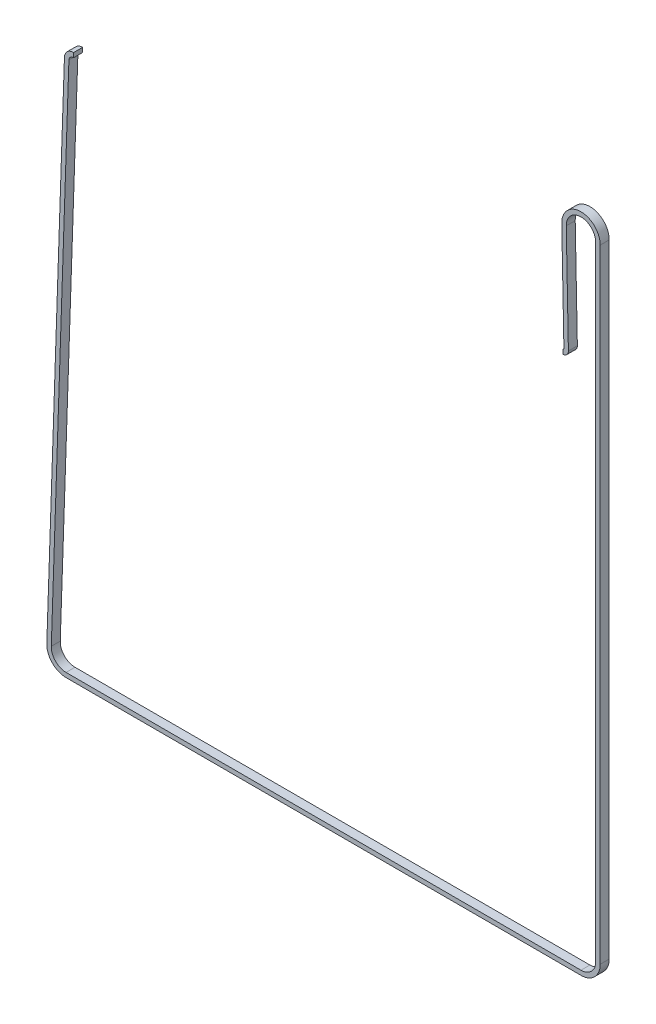
ISO-10303-21;
HEADER;
FILE_DESCRIPTION(('STEP AP214'),'2;1');
FILE_NAME('part.step','',(''),(''),'','','');
FILE_SCHEMA(('AUTOMOTIVE_DESIGN { 1 0 10303 214 1 1 1 1 }'));
ENDSEC;
DATA;
#1=APPLICATION_CONTEXT('core data for automotive mechanical design processes');
#2=APPLICATION_PROTOCOL_DEFINITION('international standard','automotive_design',2000,#1);
#3=PRODUCT_CONTEXT('',#1,'mechanical');
#4=PRODUCT('Part','Part','',(#3));
#5=PRODUCT_RELATED_PRODUCT_CATEGORY('part','',(#4));
#6=PRODUCT_DEFINITION_FORMATION('','',#4);
#7=PRODUCT_DEFINITION_CONTEXT('part definition',#1,'design');
#8=PRODUCT_DEFINITION('design','',#6,#7);
#9=PRODUCT_DEFINITION_SHAPE('','',#8);
#10=(LENGTH_UNIT() NAMED_UNIT(*) SI_UNIT(.MILLI.,.METRE.));
#11=(NAMED_UNIT(*) PLANE_ANGLE_UNIT() SI_UNIT($,.RADIAN.));
#12=(NAMED_UNIT(*) SI_UNIT($,.STERADIAN.) SOLID_ANGLE_UNIT());
#13=UNCERTAINTY_MEASURE_WITH_UNIT(LENGTH_MEASURE(1.E-05),#10,'distance_accuracy_value','');
#14=(GEOMETRIC_REPRESENTATION_CONTEXT(3) GLOBAL_UNCERTAINTY_ASSIGNED_CONTEXT((#13)) GLOBAL_UNIT_ASSIGNED_CONTEXT((#10,
#11,#12)) REPRESENTATION_CONTEXT('',''));
#15=CARTESIAN_POINT('',(0.,0.,0.));
#16=DIRECTION('',(0.,0.,1.));
#17=DIRECTION('',(1.,0.,0.));
#18=AXIS2_PLACEMENT_3D('',#15,#16,#17);
#19=CARTESIAN_POINT('',(0.,0.,6.));
#20=DIRECTION('',(0.,0.,1.));
#21=DIRECTION('',(1.,0.,0.));
#22=AXIS2_PLACEMENT_3D('',#19,#20,#21);
#23=PLANE('',#22);
#24=DIRECTION('',(-0.999688844422703,0.0249442245179105,0.));
#25=VECTOR('',#24,1.);
#26=CARTESIAN_POINT('',(-327.646355689462,4.49928423617703,6.));
#27=LINE('',#26,#25);
#28=CARTESIAN_POINT('',(-327.571523015909,4.49741701216947,6.));
#29=VERTEX_POINT('',#28);
#30=CARTESIAN_POINT('',(-327.646355689462,4.49928423617703,6.));
#31=VERTEX_POINT('',#30);
#32=EDGE_CURVE('E251',#29,#31,#27,.T.);
#33=ORIENTED_EDGE('',*,*,#32,.F.);
#34=DIRECTION('',(0.,-1.,0.));
#35=VECTOR('',#34,1.);
#36=CARTESIAN_POINT('',(-327.571523015909,7.49835076944514,6.));
#37=LINE('',#36,#35);
#38=CARTESIAN_POINT('',(-327.571523015909,7.49835076944514,6.));
#39=VERTEX_POINT('',#38);
#40=EDGE_CURVE('E119',#39,#29,#37,.T.);
#41=ORIENTED_EDGE('',*,*,#40,.F.);
#42=CARTESIAN_POINT('',(-327.721188363016,1.50021770290892,6.));
#43=DIRECTION('',(0.,0.,1.));
#44=DIRECTION('',(1.,0.,0.));
#45=AXIS2_PLACEMENT_3D('',#42,#43,#44);
#46=CIRCLE('',#45,5.99999999999999);
#47=CARTESIAN_POINT('',(-333.717699051977,1.70481378590423,6.));
#48=VERTEX_POINT('',#47);
#49=EDGE_CURVE('E248',#39,#48,#46,.T.);
#50=ORIENTED_EDGE('',*,*,#49,.T.);
#51=DIRECTION('',(-0.0340993471658843,-0.999418448160159,0.));
#52=VECTOR('',#51,1.);
#53=CARTESIAN_POINT('',(-345.517294817155,-344.129774518172,6.));
#54=LINE('',#53,#52);
#55=CARTESIAN_POINT('',(-345.517294817155,-344.129774518172,5.99999999999999));
#56=VERTEX_POINT('',#55);
#57=EDGE_CURVE('E257',#48,#56,#54,.T.);
#58=ORIENTED_EDGE('',*,*,#57,.T.);
#59=CARTESIAN_POINT('',(-332.649782297093,-344.568803612933,6.));
#60=DIRECTION('',(0.,0.,1.));
#61=DIRECTION('',(1.,0.,0.));
#62=AXIS2_PLACEMENT_3D('',#59,#60,#61);
#63=CIRCLE('',#62,12.875);
#64=CARTESIAN_POINT('',(-332.660093745103,-357.443799483769,6.));
#65=VERTEX_POINT('',#64);
#66=EDGE_CURVE('E260',#56,#65,#63,.T.);
#67=ORIENTED_EDGE('',*,*,#66,.T.);
#68=DIRECTION('',(0.999999679288221,-0.000800889165848115,0.));
#69=VECTOR('',#68,1.);
#70=CARTESIAN_POINT('',(12.1019062548983,-357.719915722919,6.));
#71=LINE('',#70,#69);
#72=CARTESIAN_POINT('',(12.1019062548983,-357.719915722919,6.));
#73=VERTEX_POINT('',#72);
#74=EDGE_CURVE('E268',#65,#73,#71,.T.);
#75=ORIENTED_EDGE('',*,*,#74,.T.);
#76=CARTESIAN_POINT('',(12.1122177029086,-344.844919852083,6.));
#77=DIRECTION('',(0.,0.,1.));
#78=DIRECTION('',(1.,0.,0.));
#79=AXIS2_PLACEMENT_3D('',#76,#77,#78);
#80=CIRCLE('',#79,12.875);
#81=CARTESIAN_POINT('',(24.9872177029086,-344.844919852083,6.));
#82=VERTEX_POINT('',#81);
#83=EDGE_CURVE('E270',#73,#82,#80,.T.);
#84=ORIENTED_EDGE('',*,*,#83,.T.);
#85=DIRECTION('',(0.,1.,0.));
#86=VECTOR('',#85,1.);
#87=CARTESIAN_POINT('',(24.9872177029077,72.140791801586,6.));
#88=LINE('',#87,#86);
#89=CARTESIAN_POINT('',(24.9872177029077,72.140791801586,6.));
#90=VERTEX_POINT('',#89);
#91=EDGE_CURVE('E272',#82,#90,#88,.T.);
#92=ORIENTED_EDGE('',*,*,#91,.T.);
#93=CARTESIAN_POINT('',(12.1122177029086,72.1407918015422,6.));
#94=DIRECTION('',(0.,0.,1.));
#95=DIRECTION('',(1.,0.,0.));
#96=AXIS2_PLACEMENT_3D('',#93,#94,#95);
#97=CIRCLE('',#96,12.8749999999996);
#98=CARTESIAN_POINT('',(-0.760216383496831,71.8837593305649,6.));
#99=VERTEX_POINT('',#98);
#100=EDGE_CURVE('E274',#90,#99,#97,.T.);
#101=ORIENTED_EDGE('',*,*,#100,.T.);
#102=DIRECTION('',(0.0199636870706291,-0.999800705740172,0.));
#103=VECTOR('',#102,1.);
#104=CARTESIAN_POINT('',(0.67486547637462,0.0134754887726744,6.));
#105=LINE('',#104,#103);
#106=CARTESIAN_POINT('',(0.67486547637462,0.0134754887726744,6.));
#107=VERTEX_POINT('',#106);
#108=EDGE_CURVE('E276',#99,#107,#105,.T.);
#109=ORIENTED_EDGE('',*,*,#108,.T.);
#110=CARTESIAN_POINT('',(0.,0.,6.));
#111=DIRECTION('',(0.,0.,1.));
#112=DIRECTION('',(1.,0.,0.));
#113=AXIS2_PLACEMENT_3D('',#110,#111,#112);
#114=CIRCLE('',#113,0.675000000000004);
#115=CARTESIAN_POINT('',(7.1802235205468E-05,-0.67499999618107,6.));
#116=VERTEX_POINT('',#115);
#117=EDGE_CURVE('E258',#107,#116,#114,.F.);
#118=ORIENTED_EDGE('',*,*,#117,.T.);
#119=DIRECTION('',(0.,1.,0.));
#120=VECTOR('',#119,1.);
#121=CARTESIAN_POINT('',(7.18022352130809E-05,7.49835076944514,6.));
#122=LINE('',#121,#120);
#123=CARTESIAN_POINT('',(7.18022352026737E-05,-3.67499999929857,6.));
#124=VERTEX_POINT('',#123);
#125=EDGE_CURVE('E252',#124,#116,#122,.T.);
#126=ORIENTED_EDGE('',*,*,#125,.F.);
#127=CARTESIAN_POINT('',(0.,0.,6.));
#128=DIRECTION('',(0.,0.,-1.));
#129=DIRECTION('',(1.,0.,0.));
#130=AXIS2_PLACEMENT_3D('',#127,#128,#129);
#131=CIRCLE('',#130,3.675);
#132=CARTESIAN_POINT('',(3.67426759359514,0.0733665499845618,6.));
#133=VERTEX_POINT('',#132);
#134=EDGE_CURVE('E335',#133,#124,#131,.T.);
#135=ORIENTED_EDGE('',*,*,#134,.F.);
#136=DIRECTION('',(0.0199636870706291,-0.999800705740172,0.));
#137=VECTOR('',#136,1.);
#138=CARTESIAN_POINT('',(3.67426759359514,0.0733665499845618,6.));
#139=LINE('',#138,#137);
#140=CARTESIAN_POINT('',(2.23918573372351,71.9436503917635,6.));
#141=VERTEX_POINT('',#140);
#142=EDGE_CURVE('E355',#141,#133,#139,.T.);
#143=ORIENTED_EDGE('',*,*,#142,.F.);
#144=CARTESIAN_POINT('',(12.1122177029086,72.1407918015422,6.));
#145=DIRECTION('',(0.,0.,1.));
#146=DIRECTION('',(-1.,0.,0.));
#147=AXIS2_PLACEMENT_3D('',#144,#145,#146);
#148=CIRCLE('',#147,9.87499999999956);
#149=CARTESIAN_POINT('',(21.9872177029077,72.140791801586,6.));
#150=VERTEX_POINT('',#149);
#151=EDGE_CURVE('E352',#150,#141,#148,.T.);
#152=ORIENTED_EDGE('',*,*,#151,.F.);
#153=DIRECTION('',(0.,1.,0.));
#154=VECTOR('',#153,1.);
#155=CARTESIAN_POINT('',(21.9872177029077,72.140791801586,6.));
#156=LINE('',#155,#154);
#157=CARTESIAN_POINT('',(21.9872177029086,-344.844919852083,6.));
#158=VERTEX_POINT('',#157);
#159=EDGE_CURVE('E350',#158,#150,#156,.T.);
#160=ORIENTED_EDGE('',*,*,#159,.F.);
#161=CARTESIAN_POINT('',(12.1122177029086,-344.844919852083,6.));
#162=DIRECTION('',(0.,0.,1.));
#163=DIRECTION('',(-1.,0.,0.));
#164=AXIS2_PLACEMENT_3D('',#161,#162,#163);
#165=CIRCLE('',#164,9.87499999999999);
#166=CARTESIAN_POINT('',(12.1043089223958,-354.719916685054,6.));
#167=VERTEX_POINT('',#166);
#168=EDGE_CURVE('E348',#167,#158,#165,.T.);
#169=ORIENTED_EDGE('',*,*,#168,.F.);
#170=DIRECTION('',(0.999999679288221,-0.000800889165848115,0.));
#171=VECTOR('',#170,1.);
#172=CARTESIAN_POINT('',(12.1043089223958,-354.719916685054,6.));
#173=LINE('',#172,#171);
#174=CARTESIAN_POINT('',(-332.657691077606,-354.443800445904,6.));
#175=VERTEX_POINT('',#174);
#176=EDGE_CURVE('E346',#175,#167,#173,.T.);
#177=ORIENTED_EDGE('',*,*,#176,.F.);
#178=CARTESIAN_POINT('',(-332.649782297093,-344.568803612933,6.));
#179=DIRECTION('',(0.,0.,1.));
#180=DIRECTION('',(-1.,0.,0.));
#181=AXIS2_PLACEMENT_3D('',#178,#179,#180);
#182=CIRCLE('',#181,9.87499999999999);
#183=CARTESIAN_POINT('',(-342.519039472675,-344.23207255967,6.));
#184=VERTEX_POINT('',#183);
#185=EDGE_CURVE('E344',#184,#175,#182,.T.);
#186=ORIENTED_EDGE('',*,*,#185,.F.);
#187=DIRECTION('',(-0.0340993471658842,-0.999418448160159,0.));
#188=VECTOR('',#187,1.);
#189=CARTESIAN_POINT('',(-342.519039472675,-344.23207255967,6.));
#190=LINE('',#189,#188);
#191=CARTESIAN_POINT('',(-330.719443707497,1.60251574440658,6.));
#192=VERTEX_POINT('',#191);
#193=EDGE_CURVE('E342',#192,#184,#190,.T.);
#194=ORIENTED_EDGE('',*,*,#193,.F.);
#195=CARTESIAN_POINT('',(-327.721188363016,1.50021770290892,6.));
#196=DIRECTION('',(0.,0.,1.));
#197=DIRECTION('',(-1.,0.,0.));
#198=AXIS2_PLACEMENT_3D('',#195,#196,#197);
#199=CIRCLE('',#198,2.99999999999999);
#200=EDGE_CURVE('E340',#31,#192,#199,.T.);
#201=ORIENTED_EDGE('',*,*,#200,.F.);
#202=EDGE_LOOP('',(#33,#41,#50,#58,#67,#75,#84,#92,#101,#109,#118,#126,#135,#143,#152,#160,#169,
#177,#186,#194,#201));
#203=FACE_BOUND('',#202,.T.);
#204=ADVANCED_FACE('F97',(#203),#23,.T.);
#205=CARTESIAN_POINT('',(0.,0.,0.));
#206=DIRECTION('',(0.,0.,1.));
#207=DIRECTION('',(1.,0.,0.));
#208=AXIS2_PLACEMENT_3D('',#205,#206,#207);
#209=PLANE('',#208);
#210=DIRECTION('',(0.,-1.,0.));
#211=VECTOR('',#210,1.);
#212=CARTESIAN_POINT('',(-327.571523015909,7.49835076944514,0.));
#213=LINE('',#212,#211);
#214=CARTESIAN_POINT('',(-327.571523015909,7.49835076944514,0.));
#215=VERTEX_POINT('',#214);
#216=CARTESIAN_POINT('',(-327.571523015909,4.49741701216947,0.));
#217=VERTEX_POINT('',#216);
#218=EDGE_CURVE('E240',#215,#217,#213,.T.);
#219=ORIENTED_EDGE('',*,*,#218,.T.);
#220=DIRECTION('',(-0.999688844422703,0.0249442245179105,0.));
#221=VECTOR('',#220,1.);
#222=CARTESIAN_POINT('',(-327.646355689462,4.49928423617703,0.));
#223=LINE('',#222,#221);
#224=CARTESIAN_POINT('',(-327.646355689462,4.49928423617703,0.));
#225=VERTEX_POINT('',#224);
#226=EDGE_CURVE('E323',#217,#225,#223,.T.);
#227=ORIENTED_EDGE('',*,*,#226,.T.);
#228=CARTESIAN_POINT('',(-327.721188363016,1.50021770290892,0.));
#229=DIRECTION('',(0.,0.,1.));
#230=DIRECTION('',(-1.,0.,0.));
#231=AXIS2_PLACEMENT_3D('',#228,#229,#230);
#232=CIRCLE('',#231,2.99999999999999);
#233=CARTESIAN_POINT('',(-330.719443707497,1.60251574440658,0.));
#234=VERTEX_POINT('',#233);
#235=EDGE_CURVE('E361',#225,#234,#232,.T.);
#236=ORIENTED_EDGE('',*,*,#235,.T.);
#237=DIRECTION('',(-0.0340993471658842,-0.999418448160159,0.));
#238=VECTOR('',#237,1.);
#239=CARTESIAN_POINT('',(-342.519039472675,-344.23207255967,0.));
#240=LINE('',#239,#238);
#241=CARTESIAN_POINT('',(-342.519039472675,-344.23207255967,0.));
#242=VERTEX_POINT('',#241);
#243=EDGE_CURVE('E363',#234,#242,#240,.T.);
#244=ORIENTED_EDGE('',*,*,#243,.T.);
#245=CARTESIAN_POINT('',(-332.649782297093,-344.568803612933,0.));
#246=DIRECTION('',(0.,0.,1.));
#247=DIRECTION('',(-1.,0.,0.));
#248=AXIS2_PLACEMENT_3D('',#245,#246,#247);
#249=CIRCLE('',#248,9.87499999999999);
#250=CARTESIAN_POINT('',(-332.657691077606,-354.443800445904,0.));
#251=VERTEX_POINT('',#250);
#252=EDGE_CURVE('E366',#242,#251,#249,.T.);
#253=ORIENTED_EDGE('',*,*,#252,.T.);
#254=DIRECTION('',(0.999999679288221,-0.000800889165848115,0.));
#255=VECTOR('',#254,1.);
#256=CARTESIAN_POINT('',(12.1043089223958,-354.719916685054,0.));
#257=LINE('',#256,#255);
#258=CARTESIAN_POINT('',(12.1043089223958,-354.719916685054,0.));
#259=VERTEX_POINT('',#258);
#260=EDGE_CURVE('E369',#251,#259,#257,.T.);
#261=ORIENTED_EDGE('',*,*,#260,.T.);
#262=CARTESIAN_POINT('',(12.1122177029086,-344.844919852083,0.));
#263=DIRECTION('',(0.,0.,1.));
#264=DIRECTION('',(-1.,0.,0.));
#265=AXIS2_PLACEMENT_3D('',#262,#263,#264);
#266=CIRCLE('',#265,9.87499999999999);
#267=CARTESIAN_POINT('',(21.9872177029086,-344.844919852083,0.));
#268=VERTEX_POINT('',#267);
#269=EDGE_CURVE('E372',#259,#268,#266,.T.);
#270=ORIENTED_EDGE('',*,*,#269,.T.);
#271=DIRECTION('',(0.,1.,0.));
#272=VECTOR('',#271,1.);
#273=CARTESIAN_POINT('',(21.9872177029077,72.140791801586,0.));
#274=LINE('',#273,#272);
#275=CARTESIAN_POINT('',(21.9872177029077,72.140791801586,0.));
#276=VERTEX_POINT('',#275);
#277=EDGE_CURVE('E375',#268,#276,#274,.T.);
#278=ORIENTED_EDGE('',*,*,#277,.T.);
#279=CARTESIAN_POINT('',(12.1122177029086,72.1407918015422,0.));
#280=DIRECTION('',(0.,0.,1.));
#281=DIRECTION('',(-1.,0.,0.));
#282=AXIS2_PLACEMENT_3D('',#279,#280,#281);
#283=CIRCLE('',#282,9.87499999999956);
#284=CARTESIAN_POINT('',(2.23918573372395,71.9436503917635,0.));
#285=VERTEX_POINT('',#284);
#286=EDGE_CURVE('E378',#276,#285,#283,.T.);
#287=ORIENTED_EDGE('',*,*,#286,.T.);
#288=DIRECTION('',(0.0199636870706291,-0.999800705740172,0.));
#289=VECTOR('',#288,1.);
#290=CARTESIAN_POINT('',(3.67426759359514,0.0733665499845618,0.));
#291=LINE('',#290,#289);
#292=CARTESIAN_POINT('',(3.67426759359514,0.0733665499845618,0.));
#293=VERTEX_POINT('',#292);
#294=EDGE_CURVE('E338',#285,#293,#291,.T.);
#295=ORIENTED_EDGE('',*,*,#294,.T.);
#296=CARTESIAN_POINT('',(0.,0.,0.));
#297=DIRECTION('',(0.,0.,-1.));
#298=DIRECTION('',(1.,0.,0.));
#299=AXIS2_PLACEMENT_3D('',#296,#297,#298);
#300=CIRCLE('',#299,3.675);
#301=CARTESIAN_POINT('',(7.18022352026737E-05,-3.67499999929857,0.));
#302=VERTEX_POINT('',#301);
#303=EDGE_CURVE('E334',#293,#302,#300,.T.);
#304=ORIENTED_EDGE('',*,*,#303,.T.);
#305=DIRECTION('',(0.,1.,0.));
#306=VECTOR('',#305,1.);
#307=CARTESIAN_POINT('',(7.18022352130809E-05,7.49835076944514,0.));
#308=LINE('',#307,#306);
#309=CARTESIAN_POINT('',(7.1802235205468E-05,-0.67499999618107,0.));
#310=VERTEX_POINT('',#309);
#311=EDGE_CURVE('E112',#302,#310,#308,.T.);
#312=ORIENTED_EDGE('',*,*,#311,.T.);
#313=CARTESIAN_POINT('',(0.,0.,0.));
#314=DIRECTION('',(0.,0.,1.));
#315=DIRECTION('',(1.,0.,0.));
#316=AXIS2_PLACEMENT_3D('',#313,#314,#315);
#317=CIRCLE('',#316,0.675000000000004);
#318=CARTESIAN_POINT('',(0.67486547637462,0.0134754887726744,0.));
#319=VERTEX_POINT('',#318);
#320=EDGE_CURVE('E279',#319,#310,#317,.F.);
#321=ORIENTED_EDGE('',*,*,#320,.F.);
#322=DIRECTION('',(0.0199636870706291,-0.999800705740172,0.));
#323=VECTOR('',#322,1.);
#324=CARTESIAN_POINT('',(0.67486547637462,0.0134754887726744,0.));
#325=LINE('',#324,#323);
#326=CARTESIAN_POINT('',(-0.760216383496831,71.8837593305649,0.));
#327=VERTEX_POINT('',#326);
#328=EDGE_CURVE('E263',#327,#319,#325,.T.);
#329=ORIENTED_EDGE('',*,*,#328,.F.);
#330=CARTESIAN_POINT('',(12.1122177029086,72.1407918015422,0.));
#331=DIRECTION('',(0.,0.,1.));
#332=DIRECTION('',(1.,0.,0.));
#333=AXIS2_PLACEMENT_3D('',#330,#331,#332);
#334=CIRCLE('',#333,12.8749999999996);
#335=CARTESIAN_POINT('',(24.9872177029077,72.140791801586,0.));
#336=VERTEX_POINT('',#335);
#337=EDGE_CURVE('E295',#336,#327,#334,.T.);
#338=ORIENTED_EDGE('',*,*,#337,.F.);
#339=DIRECTION('',(0.,1.,0.));
#340=VECTOR('',#339,1.);
#341=CARTESIAN_POINT('',(24.9872177029077,72.140791801586,0.));
#342=LINE('',#341,#340);
#343=CARTESIAN_POINT('',(24.9872177029086,-344.844919852083,0.));
#344=VERTEX_POINT('',#343);
#345=EDGE_CURVE('E293',#344,#336,#342,.T.);
#346=ORIENTED_EDGE('',*,*,#345,.F.);
#347=CARTESIAN_POINT('',(12.1122177029086,-344.844919852083,0.));
#348=DIRECTION('',(0.,0.,1.));
#349=DIRECTION('',(1.,0.,0.));
#350=AXIS2_PLACEMENT_3D('',#347,#348,#349);
#351=CIRCLE('',#350,12.875);
#352=CARTESIAN_POINT('',(12.1019062548983,-357.719915722919,0.));
#353=VERTEX_POINT('',#352);
#354=EDGE_CURVE('E291',#353,#344,#351,.T.);
#355=ORIENTED_EDGE('',*,*,#354,.F.);
#356=DIRECTION('',(0.999999679288221,-0.000800889165848115,0.));
#357=VECTOR('',#356,1.);
#358=CARTESIAN_POINT('',(12.1019062548983,-357.719915722919,0.));
#359=LINE('',#358,#357);
#360=CARTESIAN_POINT('',(-332.660093745103,-357.443799483769,0.));
#361=VERTEX_POINT('',#360);
#362=EDGE_CURVE('E289',#361,#353,#359,.T.);
#363=ORIENTED_EDGE('',*,*,#362,.F.);
#364=CARTESIAN_POINT('',(-332.649782297093,-344.568803612933,0.));
#365=DIRECTION('',(0.,0.,1.));
#366=DIRECTION('',(1.,0.,0.));
#367=AXIS2_PLACEMENT_3D('',#364,#365,#366);
#368=CIRCLE('',#367,12.875);
#369=CARTESIAN_POINT('',(-345.517294817155,-344.129774518172,0.));
#370=VERTEX_POINT('',#369);
#371=EDGE_CURVE('E287',#370,#361,#368,.T.);
#372=ORIENTED_EDGE('',*,*,#371,.F.);
#373=DIRECTION('',(-0.0340993471658843,-0.999418448160159,0.));
#374=VECTOR('',#373,1.);
#375=CARTESIAN_POINT('',(-345.517294817155,-344.129774518172,0.));
#376=LINE('',#375,#374);
#377=CARTESIAN_POINT('',(-333.717699051977,1.70481378590423,0.));
#378=VERTEX_POINT('',#377);
#379=EDGE_CURVE('E285',#378,#370,#376,.T.);
#380=ORIENTED_EDGE('',*,*,#379,.F.);
#381=CARTESIAN_POINT('',(-327.721188363016,1.50021770290892,0.));
#382=DIRECTION('',(0.,0.,1.));
#383=DIRECTION('',(1.,0.,0.));
#384=AXIS2_PLACEMENT_3D('',#381,#382,#383);
#385=CIRCLE('',#384,5.99999999999999);
#386=EDGE_CURVE('E282',#215,#378,#385,.T.);
#387=ORIENTED_EDGE('',*,*,#386,.F.);
#388=EDGE_LOOP('',(#219,#227,#236,#244,#253,#261,#270,#278,#287,#295,#304,#312,#321,#329,#338,
#346,#355,#363,#372,#380,#387));
#389=FACE_BOUND('',#388,.T.);
#390=ADVANCED_FACE('F325',(#389),#209,.F.);
#391=CARTESIAN_POINT('',(0.,0.,6.));
#392=DIRECTION('',(0.,0.,-1.));
#393=DIRECTION('',(-1.,0.,0.));
#394=AXIS2_PLACEMENT_3D('',#391,#392,#393);
#395=CYLINDRICAL_SURFACE('',#394,0.675000000000004);
#396=DIRECTION('',(0.,0.,-1.));
#397=VECTOR('',#396,1.);
#398=CARTESIAN_POINT('',(7.1802235205468E-05,-0.67499999618107,6.));
#399=LINE('',#398,#397);
#400=EDGE_CURVE('E332',#116,#310,#399,.T.);
#401=ORIENTED_EDGE('',*,*,#400,.F.);
#402=ORIENTED_EDGE('',*,*,#117,.F.);
#403=DIRECTION('',(0.,0.,-1.));
#404=VECTOR('',#403,1.);
#405=CARTESIAN_POINT('',(0.67486547637462,0.0134754887726744,6.));
#406=LINE('',#405,#404);
#407=EDGE_CURVE('E278',#107,#319,#406,.T.);
#408=ORIENTED_EDGE('',*,*,#407,.T.);
#409=ORIENTED_EDGE('',*,*,#320,.T.);
#410=EDGE_LOOP('',(#401,#402,#408,#409));
#411=FACE_BOUND('',#410,.T.);
#412=ADVANCED_FACE('F99',(#411),#395,.F.);
#413=CARTESIAN_POINT('',(0.,0.,6.));
#414=DIRECTION('',(0.,0.,-1.));
#415=DIRECTION('',(-1.,0.,0.));
#416=AXIS2_PLACEMENT_3D('',#413,#414,#415);
#417=CYLINDRICAL_SURFACE('',#416,3.675);
#418=ORIENTED_EDGE('',*,*,#134,.T.);
#419=DIRECTION('',(0.,0.,-1.));
#420=VECTOR('',#419,1.);
#421=CARTESIAN_POINT('',(7.18022352026737E-05,-3.67499999929857,6.));
#422=LINE('',#421,#420);
#423=EDGE_CURVE('E12',#124,#302,#422,.T.);
#424=ORIENTED_EDGE('',*,*,#423,.T.);
#425=ORIENTED_EDGE('',*,*,#303,.F.);
#426=DIRECTION('',(0.,0.,-1.));
#427=VECTOR('',#426,1.);
#428=CARTESIAN_POINT('',(3.67426759359514,0.0733665499845618,6.));
#429=LINE('',#428,#427);
#430=EDGE_CURVE('E357',#133,#293,#429,.T.);
#431=ORIENTED_EDGE('',*,*,#430,.F.);
#432=EDGE_LOOP('',(#418,#424,#425,#431));
#433=FACE_BOUND('',#432,.T.);
#434=ADVANCED_FACE('F438',(#433),#417,.T.);
#435=CARTESIAN_POINT('',(-327.646355689462,4.49928423617703,6.));
#436=DIRECTION('',(-0.0249442245179105,-0.999688844422703,0.));
#437=DIRECTION('',(0.999688844422704,-0.0249442245179105,0.));
#438=AXIS2_PLACEMENT_3D('',#435,#436,#437);
#439=PLANE('',#438);
#440=ORIENTED_EDGE('',*,*,#226,.F.);
#441=DIRECTION('',(0.,0.,1.));
#442=VECTOR('',#441,1.);
#443=CARTESIAN_POINT('',(-327.571523015909,4.49741701216947,6.));
#444=LINE('',#443,#442);
#445=EDGE_CURVE('E105',#217,#29,#444,.T.);
#446=ORIENTED_EDGE('',*,*,#445,.T.);
#447=ORIENTED_EDGE('',*,*,#32,.T.);
#448=DIRECTION('',(0.,0.,-1.));
#449=VECTOR('',#448,1.);
#450=CARTESIAN_POINT('',(-327.646355689462,4.49928423617703,6.));
#451=LINE('',#450,#449);
#452=EDGE_CURVE('E283',#31,#225,#451,.T.);
#453=ORIENTED_EDGE('',*,*,#452,.T.);
#454=EDGE_LOOP('',(#440,#446,#447,#453));
#455=FACE_BOUND('',#454,.T.);
#456=ADVANCED_FACE('F320',(#455),#439,.T.);
#457=CARTESIAN_POINT('',(-327.721188363016,1.50021770290892,6.));
#458=DIRECTION('',(0.,0.,-1.));
#459=DIRECTION('',(-1.,0.,0.));
#460=AXIS2_PLACEMENT_3D('',#457,#458,#459);
#461=CYLINDRICAL_SURFACE('',#460,5.99999999999999);
#462=ORIENTED_EDGE('',*,*,#386,.T.);
#463=DIRECTION('',(0.,0.,-1.));
#464=VECTOR('',#463,1.);
#465=CARTESIAN_POINT('',(-333.717699051977,1.70481378590423,6.));
#466=LINE('',#465,#464);
#467=EDGE_CURVE('E244',#48,#378,#466,.T.);
#468=ORIENTED_EDGE('',*,*,#467,.F.);
#469=ORIENTED_EDGE('',*,*,#49,.F.);
#470=DIRECTION('',(0.,0.,-1.));
#471=VECTOR('',#470,1.);
#472=CARTESIAN_POINT('',(-327.571523015909,7.49835076944514,5.99999999999999));
#473=LINE('',#472,#471);
#474=EDGE_CURVE('E237',#39,#215,#473,.T.);
#475=ORIENTED_EDGE('',*,*,#474,.T.);
#476=EDGE_LOOP('',(#462,#468,#469,#475));
#477=FACE_BOUND('',#476,.T.);
#478=ADVANCED_FACE('F254',(#477),#461,.T.);
#479=CARTESIAN_POINT('',(-345.517294817155,-344.129774518172,6.));
#480=DIRECTION('',(0.999418448160159,-0.0340993471658843,0.));
#481=DIRECTION('',(0.0340993471658843,0.999418448160159,0.));
#482=AXIS2_PLACEMENT_3D('',#479,#480,#481);
#483=PLANE('',#482);
#484=ORIENTED_EDGE('',*,*,#379,.T.);
#485=DIRECTION('',(0.,0.,-1.));
#486=VECTOR('',#485,1.);
#487=CARTESIAN_POINT('',(-345.517294817155,-344.129774518172,5.99999999999999));
#488=LINE('',#487,#486);
#489=EDGE_CURVE('E315',#56,#370,#488,.T.);
#490=ORIENTED_EDGE('',*,*,#489,.F.);
#491=ORIENTED_EDGE('',*,*,#57,.F.);
#492=ORIENTED_EDGE('',*,*,#467,.T.);
#493=EDGE_LOOP('',(#484,#490,#491,#492));
#494=FACE_BOUND('',#493,.T.);
#495=ADVANCED_FACE('F477',(#494),#483,.F.);
#496=CARTESIAN_POINT('',(-332.649782297093,-344.568803612933,6.));
#497=DIRECTION('',(0.,0.,-1.));
#498=DIRECTION('',(-1.,0.,0.));
#499=AXIS2_PLACEMENT_3D('',#496,#497,#498);
#500=CYLINDRICAL_SURFACE('',#499,12.875);
#501=ORIENTED_EDGE('',*,*,#371,.T.);
#502=DIRECTION('',(0.,0.,-1.));
#503=VECTOR('',#502,1.);
#504=CARTESIAN_POINT('',(-332.660093745103,-357.443799483769,6.));
#505=LINE('',#504,#503);
#506=EDGE_CURVE('E312',#65,#361,#505,.T.);
#507=ORIENTED_EDGE('',*,*,#506,.F.);
#508=ORIENTED_EDGE('',*,*,#66,.F.);
#509=ORIENTED_EDGE('',*,*,#489,.T.);
#510=EDGE_LOOP('',(#501,#507,#508,#509));
#511=FACE_BOUND('',#510,.T.);
#512=ADVANCED_FACE('F474',(#511),#500,.T.);
#513=CARTESIAN_POINT('',(12.1019062548983,-357.719915722919,6.));
#514=DIRECTION('',(0.000800889165848115,0.999999679288221,0.));
#515=DIRECTION('',(-0.999999679288221,0.000800889165848115,0.));
#516=AXIS2_PLACEMENT_3D('',#513,#514,#515);
#517=PLANE('',#516);
#518=ORIENTED_EDGE('',*,*,#362,.T.);
#519=DIRECTION('',(0.,0.,-1.));
#520=VECTOR('',#519,1.);
#521=CARTESIAN_POINT('',(12.1019062548983,-357.719915722919,6.));
#522=LINE('',#521,#520);
#523=EDGE_CURVE('E309',#73,#353,#522,.T.);
#524=ORIENTED_EDGE('',*,*,#523,.F.);
#525=ORIENTED_EDGE('',*,*,#74,.F.);
#526=ORIENTED_EDGE('',*,*,#506,.T.);
#527=EDGE_LOOP('',(#518,#524,#525,#526));
#528=FACE_BOUND('',#527,.T.);
#529=ADVANCED_FACE('F470',(#528),#517,.F.);
#530=CARTESIAN_POINT('',(12.1122177029086,-344.844919852083,6.));
#531=DIRECTION('',(0.,0.,-1.));
#532=DIRECTION('',(-1.,0.,0.));
#533=AXIS2_PLACEMENT_3D('',#530,#531,#532);
#534=CYLINDRICAL_SURFACE('',#533,12.875);
#535=ORIENTED_EDGE('',*,*,#354,.T.);
#536=DIRECTION('',(0.,0.,-1.));
#537=VECTOR('',#536,1.);
#538=CARTESIAN_POINT('',(24.9872177029086,-344.844919852083,6.));
#539=LINE('',#538,#537);
#540=EDGE_CURVE('E306',#82,#344,#539,.T.);
#541=ORIENTED_EDGE('',*,*,#540,.F.);
#542=ORIENTED_EDGE('',*,*,#83,.F.);
#543=ORIENTED_EDGE('',*,*,#523,.T.);
#544=EDGE_LOOP('',(#535,#541,#542,#543));
#545=FACE_BOUND('',#544,.T.);
#546=ADVANCED_FACE('F465',(#545),#534,.T.);
#547=CARTESIAN_POINT('',(24.9872177029077,72.140791801586,6.));
#548=DIRECTION('',(-1.,0.,0.));
#549=DIRECTION('',(0.,-1.,0.));
#550=AXIS2_PLACEMENT_3D('',#547,#548,#549);
#551=PLANE('',#550);
#552=ORIENTED_EDGE('',*,*,#345,.T.);
#553=DIRECTION('',(0.,0.,-1.));
#554=VECTOR('',#553,1.);
#555=CARTESIAN_POINT('',(24.9872177029077,72.140791801586,6.));
#556=LINE('',#555,#554);
#557=EDGE_CURVE('E303',#90,#336,#556,.T.);
#558=ORIENTED_EDGE('',*,*,#557,.F.);
#559=ORIENTED_EDGE('',*,*,#91,.F.);
#560=ORIENTED_EDGE('',*,*,#540,.T.);
#561=EDGE_LOOP('',(#552,#558,#559,#560));
#562=FACE_BOUND('',#561,.T.);
#563=ADVANCED_FACE('F459',(#562),#551,.F.);
#564=CARTESIAN_POINT('',(12.1122177029086,72.1407918015422,6.));
#565=DIRECTION('',(0.,0.,-1.));
#566=DIRECTION('',(-1.,0.,0.));
#567=AXIS2_PLACEMENT_3D('',#564,#565,#566);
#568=CYLINDRICAL_SURFACE('',#567,12.8749999999996);
#569=ORIENTED_EDGE('',*,*,#337,.T.);
#570=DIRECTION('',(0.,0.,-1.));
#571=VECTOR('',#570,1.);
#572=CARTESIAN_POINT('',(-0.760216383496831,71.8837593305649,6.));
#573=LINE('',#572,#571);
#574=EDGE_CURVE('E300',#99,#327,#573,.T.);
#575=ORIENTED_EDGE('',*,*,#574,.F.);
#576=ORIENTED_EDGE('',*,*,#100,.F.);
#577=ORIENTED_EDGE('',*,*,#557,.T.);
#578=EDGE_LOOP('',(#569,#575,#576,#577));
#579=FACE_BOUND('',#578,.T.);
#580=ADVANCED_FACE('F455',(#579),#568,.T.);
#581=CARTESIAN_POINT('',(0.67486547637462,0.0134754887726744,6.));
#582=DIRECTION('',(0.999800705740172,0.0199636870706291,0.));
#583=DIRECTION('',(-0.0199636870706291,0.999800705740172,0.));
#584=AXIS2_PLACEMENT_3D('',#581,#582,#583);
#585=PLANE('',#584);
#586=ORIENTED_EDGE('',*,*,#328,.T.);
#587=ORIENTED_EDGE('',*,*,#407,.F.);
#588=ORIENTED_EDGE('',*,*,#108,.F.);
#589=ORIENTED_EDGE('',*,*,#574,.T.);
#590=EDGE_LOOP('',(#586,#587,#588,#589));
#591=FACE_BOUND('',#590,.T.);
#592=ADVANCED_FACE('F450',(#591),#585,.F.);
#593=CARTESIAN_POINT('',(-327.721188363016,1.50021770290892,6.));
#594=DIRECTION('',(0.,0.,-1.));
#595=DIRECTION('',(-1.,0.,0.));
#596=AXIS2_PLACEMENT_3D('',#593,#594,#595);
#597=CYLINDRICAL_SURFACE('',#596,2.99999999999999);
#598=ORIENTED_EDGE('',*,*,#235,.F.);
#599=ORIENTED_EDGE('',*,*,#452,.F.);
#600=ORIENTED_EDGE('',*,*,#200,.T.);
#601=DIRECTION('',(0.,0.,-1.));
#602=VECTOR('',#601,1.);
#603=CARTESIAN_POINT('',(-330.719443707497,1.60251574440658,6.));
#604=LINE('',#603,#602);
#605=EDGE_CURVE('E397',#192,#234,#604,.T.);
#606=ORIENTED_EDGE('',*,*,#605,.T.);
#607=EDGE_LOOP('',(#598,#599,#600,#606));
#608=FACE_BOUND('',#607,.T.);
#609=ADVANCED_FACE('F400',(#608),#597,.F.);
#610=CARTESIAN_POINT('',(-342.519039472675,-344.23207255967,6.));
#611=DIRECTION('',(0.999418448160159,-0.0340993471658843,0.));
#612=DIRECTION('',(0.0340993471658843,0.999418448160159,0.));
#613=AXIS2_PLACEMENT_3D('',#610,#611,#612);
#614=PLANE('',#613);
#615=ORIENTED_EDGE('',*,*,#243,.F.);
#616=ORIENTED_EDGE('',*,*,#605,.F.);
#617=ORIENTED_EDGE('',*,*,#193,.T.);
#618=DIRECTION('',(0.,0.,-1.));
#619=VECTOR('',#618,1.);
#620=CARTESIAN_POINT('',(-342.519039472675,-344.23207255967,6.));
#621=LINE('',#620,#619);
#622=EDGE_CURVE('E395',#184,#242,#621,.T.);
#623=ORIENTED_EDGE('',*,*,#622,.T.);
#624=EDGE_LOOP('',(#615,#616,#617,#623));
#625=FACE_BOUND('',#624,.T.);
#626=ADVANCED_FACE('F405',(#625),#614,.T.);
#627=CARTESIAN_POINT('',(-332.649782297093,-344.568803612933,6.));
#628=DIRECTION('',(0.,0.,-1.));
#629=DIRECTION('',(-1.,0.,0.));
#630=AXIS2_PLACEMENT_3D('',#627,#628,#629);
#631=CYLINDRICAL_SURFACE('',#630,9.87499999999999);
#632=ORIENTED_EDGE('',*,*,#252,.F.);
#633=ORIENTED_EDGE('',*,*,#622,.F.);
#634=ORIENTED_EDGE('',*,*,#185,.T.);
#635=DIRECTION('',(0.,0.,-1.));
#636=VECTOR('',#635,1.);
#637=CARTESIAN_POINT('',(-332.657691077606,-354.443800445904,6.));
#638=LINE('',#637,#636);
#639=EDGE_CURVE('E393',#175,#251,#638,.T.);
#640=ORIENTED_EDGE('',*,*,#639,.T.);
#641=EDGE_LOOP('',(#632,#633,#634,#640));
#642=FACE_BOUND('',#641,.T.);
#643=ADVANCED_FACE('F410',(#642),#631,.F.);
#644=CARTESIAN_POINT('',(12.1043089223958,-354.719916685054,6.));
#645=DIRECTION('',(0.000800889165848115,0.999999679288221,0.));
#646=DIRECTION('',(-0.999999679288221,0.000800889165848115,0.));
#647=AXIS2_PLACEMENT_3D('',#644,#645,#646);
#648=PLANE('',#647);
#649=ORIENTED_EDGE('',*,*,#260,.F.);
#650=ORIENTED_EDGE('',*,*,#639,.F.);
#651=ORIENTED_EDGE('',*,*,#176,.T.);
#652=DIRECTION('',(0.,0.,-1.));
#653=VECTOR('',#652,1.);
#654=CARTESIAN_POINT('',(12.1043089223958,-354.719916685054,6.));
#655=LINE('',#654,#653);
#656=EDGE_CURVE('E391',#167,#259,#655,.T.);
#657=ORIENTED_EDGE('',*,*,#656,.T.);
#658=EDGE_LOOP('',(#649,#650,#651,#657));
#659=FACE_BOUND('',#658,.T.);
#660=ADVANCED_FACE('F415',(#659),#648,.T.);
#661=CARTESIAN_POINT('',(12.1122177029086,-344.844919852083,6.));
#662=DIRECTION('',(0.,0.,-1.));
#663=DIRECTION('',(-1.,0.,0.));
#664=AXIS2_PLACEMENT_3D('',#661,#662,#663);
#665=CYLINDRICAL_SURFACE('',#664,9.87499999999999);
#666=ORIENTED_EDGE('',*,*,#269,.F.);
#667=ORIENTED_EDGE('',*,*,#656,.F.);
#668=ORIENTED_EDGE('',*,*,#168,.T.);
#669=DIRECTION('',(0.,0.,-1.));
#670=VECTOR('',#669,1.);
#671=CARTESIAN_POINT('',(21.9872177029086,-344.844919852083,6.));
#672=LINE('',#671,#670);
#673=EDGE_CURVE('E389',#158,#268,#672,.T.);
#674=ORIENTED_EDGE('',*,*,#673,.T.);
#675=EDGE_LOOP('',(#666,#667,#668,#674));
#676=FACE_BOUND('',#675,.T.);
#677=ADVANCED_FACE('F420',(#676),#665,.F.);
#678=CARTESIAN_POINT('',(21.9872177029077,72.140791801586,6.));
#679=DIRECTION('',(-1.,0.,0.));
#680=DIRECTION('',(0.,-1.,0.));
#681=AXIS2_PLACEMENT_3D('',#678,#679,#680);
#682=PLANE('',#681);
#683=ORIENTED_EDGE('',*,*,#277,.F.);
#684=ORIENTED_EDGE('',*,*,#673,.F.);
#685=ORIENTED_EDGE('',*,*,#159,.T.);
#686=DIRECTION('',(0.,0.,-1.));
#687=VECTOR('',#686,1.);
#688=CARTESIAN_POINT('',(21.9872177029077,72.140791801586,6.));
#689=LINE('',#688,#687);
#690=EDGE_CURVE('E387',#150,#276,#689,.T.);
#691=ORIENTED_EDGE('',*,*,#690,.T.);
#692=EDGE_LOOP('',(#683,#684,#685,#691));
#693=FACE_BOUND('',#692,.T.);
#694=ADVANCED_FACE('F425',(#693),#682,.T.);
#695=CARTESIAN_POINT('',(12.1122177029086,72.1407918015422,6.));
#696=DIRECTION('',(0.,0.,-1.));
#697=DIRECTION('',(-1.,0.,0.));
#698=AXIS2_PLACEMENT_3D('',#695,#696,#697);
#699=CYLINDRICAL_SURFACE('',#698,9.87499999999956);
#700=ORIENTED_EDGE('',*,*,#286,.F.);
#701=ORIENTED_EDGE('',*,*,#690,.F.);
#702=ORIENTED_EDGE('',*,*,#151,.T.);
#703=DIRECTION('',(0.,0.,-1.));
#704=VECTOR('',#703,1.);
#705=CARTESIAN_POINT('',(2.23918573372395,71.9436503917635,6.));
#706=LINE('',#705,#704);
#707=EDGE_CURVE('E385',#141,#285,#706,.T.);
#708=ORIENTED_EDGE('',*,*,#707,.T.);
#709=EDGE_LOOP('',(#700,#701,#702,#708));
#710=FACE_BOUND('',#709,.T.);
#711=ADVANCED_FACE('F430',(#710),#699,.F.);
#712=CARTESIAN_POINT('',(3.67426759359514,0.0733665499845618,6.));
#713=DIRECTION('',(0.999800705740172,0.0199636870706291,0.));
#714=DIRECTION('',(-0.0199636870706291,0.999800705740172,0.));
#715=AXIS2_PLACEMENT_3D('',#712,#713,#714);
#716=PLANE('',#715);
#717=ORIENTED_EDGE('',*,*,#294,.F.);
#718=ORIENTED_EDGE('',*,*,#707,.F.);
#719=ORIENTED_EDGE('',*,*,#142,.T.);
#720=ORIENTED_EDGE('',*,*,#430,.T.);
#721=EDGE_LOOP('',(#717,#718,#719,#720));
#722=FACE_BOUND('',#721,.T.);
#723=ADVANCED_FACE('F433',(#722),#716,.T.);
#724=CARTESIAN_POINT('',(-327.571523015909,7.49835076944514,6.));
#725=DIRECTION('',(1.,0.,0.));
#726=DIRECTION('',(0.,0.,-1.));
#727=AXIS2_PLACEMENT_3D('',#724,#725,#726);
#728=PLANE('',#727);
#729=ORIENTED_EDGE('',*,*,#218,.F.);
#730=ORIENTED_EDGE('',*,*,#474,.F.);
#731=ORIENTED_EDGE('',*,*,#40,.T.);
#732=ORIENTED_EDGE('',*,*,#445,.F.);
#733=EDGE_LOOP('',(#729,#730,#731,#732));
#734=FACE_BOUND('',#733,.T.);
#735=ADVANCED_FACE('F238',(#734),#728,.T.);
#736=CARTESIAN_POINT('',(7.18022352130809E-05,7.49835076944514,6.));
#737=DIRECTION('',(-1.,0.,0.));
#738=DIRECTION('',(0.,-1.,0.));
#739=AXIS2_PLACEMENT_3D('',#736,#737,#738);
#740=PLANE('',#739);
#741=ORIENTED_EDGE('',*,*,#400,.T.);
#742=ORIENTED_EDGE('',*,*,#311,.F.);
#743=ORIENTED_EDGE('',*,*,#423,.F.);
#744=ORIENTED_EDGE('',*,*,#125,.T.);
#745=EDGE_LOOP('',(#741,#742,#743,#744));
#746=FACE_BOUND('',#745,.T.);
#747=ADVANCED_FACE('F442',(#746),#740,.T.);
#748=CLOSED_SHELL('',(#204,#390,#412,#434,#456,#478,#495,#512,#529,#546,#563,#580,#592,#609,
#626,#643,#660,#677,#694,#711,#723,#735,#747));
#749=MANIFOLD_SOLID_BREP('B2',#748);
#750=ADVANCED_BREP_SHAPE_REPRESENTATION('',(#18,#749),#14);
#751=SHAPE_DEFINITION_REPRESENTATION(#9,#750);
ENDSEC;
END-ISO-10303-21;
